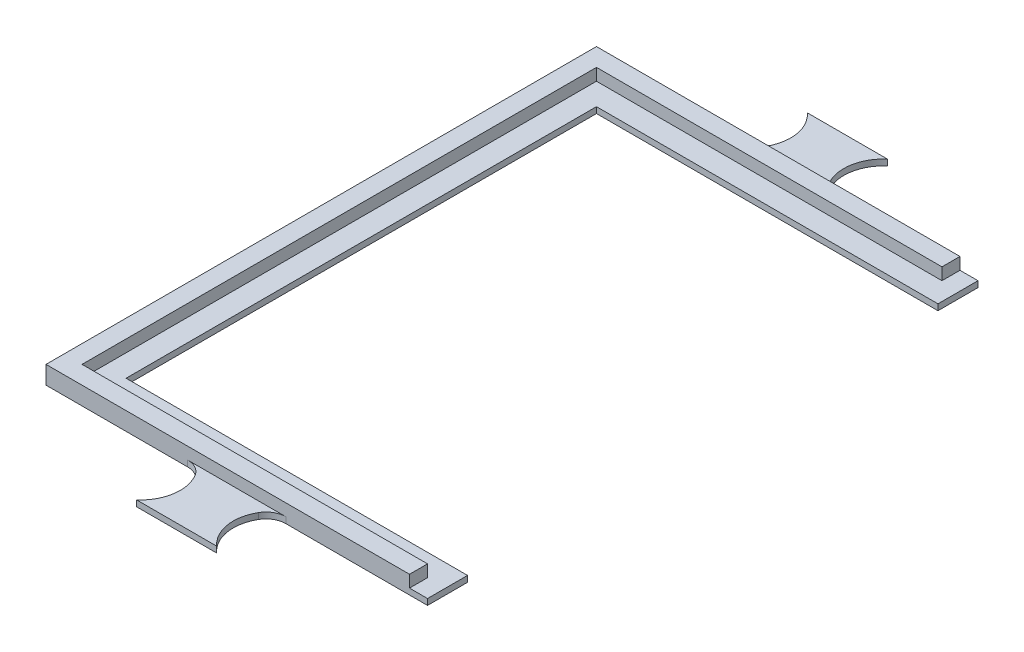
ISO-10303-21;
HEADER;
FILE_DESCRIPTION(('STEP AP214'),'2;1');
FILE_NAME('part.step','',(''),(''),'','','');
FILE_SCHEMA(('AUTOMOTIVE_DESIGN { 1 0 10303 214 1 1 1 1 }'));
ENDSEC;
DATA;
#1=APPLICATION_CONTEXT('core data for automotive mechanical design processes');
#2=APPLICATION_PROTOCOL_DEFINITION('international standard','automotive_design',2000,#1);
#3=PRODUCT_CONTEXT('',#1,'mechanical');
#4=PRODUCT('Part','Part','',(#3));
#5=PRODUCT_RELATED_PRODUCT_CATEGORY('part','',(#4));
#6=PRODUCT_DEFINITION_FORMATION('','',#4);
#7=PRODUCT_DEFINITION_CONTEXT('part definition',#1,'design');
#8=PRODUCT_DEFINITION('design','',#6,#7);
#9=PRODUCT_DEFINITION_SHAPE('','',#8);
#10=(LENGTH_UNIT() NAMED_UNIT(*) SI_UNIT(.MILLI.,.METRE.));
#11=(NAMED_UNIT(*) PLANE_ANGLE_UNIT() SI_UNIT($,.RADIAN.));
#12=(NAMED_UNIT(*) SI_UNIT($,.STERADIAN.) SOLID_ANGLE_UNIT());
#13=UNCERTAINTY_MEASURE_WITH_UNIT(LENGTH_MEASURE(1.E-05),#10,'distance_accuracy_value','');
#14=(GEOMETRIC_REPRESENTATION_CONTEXT(3) GLOBAL_UNCERTAINTY_ASSIGNED_CONTEXT((#13)) GLOBAL_UNIT_ASSIGNED_CONTEXT((#10,
#11,#12)) REPRESENTATION_CONTEXT('',''));
#15=CARTESIAN_POINT('',(0.,0.,0.));
#16=DIRECTION('',(0.,0.,1.));
#17=DIRECTION('',(1.,0.,0.));
#18=AXIS2_PLACEMENT_3D('',#15,#16,#17);
#19=CARTESIAN_POINT('',(0.,1.5,0.));
#20=DIRECTION('',(0.,1.,0.));
#21=DIRECTION('',(0.,0.,1.));
#22=AXIS2_PLACEMENT_3D('',#19,#20,#21);
#23=PLANE('',#22);
#24=DIRECTION('',(1.,0.,0.));
#25=VECTOR('',#24,1.);
#26=CARTESIAN_POINT('',(0.,1.5,68.75));
#27=LINE('',#26,#25);
#28=CARTESIAN_POINT('',(-12.2842512587393,1.5,68.75));
#29=VERTEX_POINT('',#28);
#30=CARTESIAN_POINT('',(12.2842512587393,1.5,68.75));
#31=VERTEX_POINT('',#30);
#32=EDGE_CURVE('E11',#29,#31,#27,.T.);
#33=ORIENTED_EDGE('',*,*,#32,.F.);
#34=CARTESIAN_POINT('',(-12.2842512587393,1.5,73.75));
#35=DIRECTION('',(0.,1.,0.));
#36=DIRECTION('',(0.,0.,1.));
#37=AXIS2_PLACEMENT_3D('',#34,#35,#36);
#38=CIRCLE('',#37,5.);
#39=CARTESIAN_POINT('',(-7.95412423981708,1.5,71.25));
#40=VERTEX_POINT('',#39);
#41=EDGE_CURVE('E267',#40,#29,#38,.T.);
#42=ORIENTED_EDGE('',*,*,#41,.F.);
#43=CARTESIAN_POINT('',(-16.6143782776615,1.5,76.25));
#44=DIRECTION('',(0.,1.,0.));
#45=DIRECTION('',(0.,0.,1.));
#46=AXIS2_PLACEMENT_3D('',#43,#44,#45);
#47=CIRCLE('',#46,10.);
#48=CARTESIAN_POINT('',(-9.99999999999999,1.5,83.75));
#49=VERTEX_POINT('',#48);
#50=EDGE_CURVE('E270',#40,#49,#47,.F.);
#51=ORIENTED_EDGE('',*,*,#50,.T.);
#52=DIRECTION('',(1.,0.,0.));
#53=VECTOR('',#52,1.);
#54=CARTESIAN_POINT('',(0.,1.5,83.75));
#55=LINE('',#54,#53);
#56=CARTESIAN_POINT('',(10.,1.5,83.75));
#57=VERTEX_POINT('',#56);
#58=EDGE_CURVE('E273',#49,#57,#55,.T.);
#59=ORIENTED_EDGE('',*,*,#58,.T.);
#60=CARTESIAN_POINT('',(16.6143782776615,1.5,76.25));
#61=DIRECTION('',(0.,1.,0.));
#62=DIRECTION('',(0.,0.,1.));
#63=AXIS2_PLACEMENT_3D('',#60,#61,#62);
#64=CIRCLE('',#63,10.);
#65=CARTESIAN_POINT('',(7.95412423981711,1.5,71.25));
#66=VERTEX_POINT('',#65);
#67=EDGE_CURVE('E275',#66,#57,#64,.T.);
#68=ORIENTED_EDGE('',*,*,#67,.F.);
#69=CARTESIAN_POINT('',(12.2842512587393,1.5,73.75));
#70=DIRECTION('',(0.,1.,0.));
#71=DIRECTION('',(0.,0.,1.));
#72=AXIS2_PLACEMENT_3D('',#69,#70,#71);
#73=CIRCLE('',#72,5.);
#74=EDGE_CURVE('E278',#66,#31,#73,.F.);
#75=ORIENTED_EDGE('',*,*,#74,.T.);
#76=EDGE_LOOP('',(#33,#42,#51,#59,#68,#75));
#77=FACE_BOUND('',#76,.T.);
#78=ADVANCED_FACE('F33',(#77),#23,.T.);
#79=DIRECTION('',(-1.,0.,0.));
#80=VECTOR('',#79,1.);
#81=CARTESIAN_POINT('',(0.,1.5,64.25));
#82=LINE('',#81,#80);
#83=CARTESIAN_POINT('',(43.15,1.5,64.25));
#84=VERTEX_POINT('',#83);
#85=CARTESIAN_POINT('',(-43.15,1.5,64.25));
#86=VERTEX_POINT('',#85);
#87=EDGE_CURVE('E250',#84,#86,#82,.T.);
#88=ORIENTED_EDGE('',*,*,#87,.F.);
#89=DIRECTION('',(0.,0.,1.));
#90=VECTOR('',#89,1.);
#91=CARTESIAN_POINT('',(43.15,1.5,0.));
#92=LINE('',#91,#90);
#93=CARTESIAN_POINT('',(43.15,1.5,68.75));
#94=VERTEX_POINT('',#93);
#95=EDGE_CURVE('E214',#84,#94,#92,.T.);
#96=ORIENTED_EDGE('',*,*,#95,.T.);
#97=DIRECTION('',(1.,0.,0.));
#98=VECTOR('',#97,1.);
#99=CARTESIAN_POINT('',(0.,1.5,68.75));
#100=LINE('',#99,#98);
#101=CARTESIAN_POINT('',(47.65,1.5,68.75));
#102=VERTEX_POINT('',#101);
#103=EDGE_CURVE('E280',#94,#102,#100,.T.);
#104=ORIENTED_EDGE('',*,*,#103,.T.);
#105=DIRECTION('',(0.,0.,-1.));
#106=VECTOR('',#105,1.);
#107=CARTESIAN_POINT('',(47.65,1.5,0.));
#108=LINE('',#107,#106);
#109=CARTESIAN_POINT('',(47.65,1.5,58.75));
#110=VERTEX_POINT('',#109);
#111=EDGE_CURVE('E282',#102,#110,#108,.T.);
#112=ORIENTED_EDGE('',*,*,#111,.T.);
#113=DIRECTION('',(1.,0.,0.));
#114=VECTOR('',#113,1.);
#115=CARTESIAN_POINT('',(0.,1.5,58.75));
#116=LINE('',#115,#114);
#117=CARTESIAN_POINT('',(-37.65,1.5,58.75));
#118=VERTEX_POINT('',#117);
#119=EDGE_CURVE('E284',#118,#110,#116,.T.);
#120=ORIENTED_EDGE('',*,*,#119,.F.);
#121=DIRECTION('',(0.,0.,-1.));
#122=VECTOR('',#121,1.);
#123=CARTESIAN_POINT('',(-37.65,1.5,0.));
#124=LINE('',#123,#122);
#125=CARTESIAN_POINT('',(-37.65,1.5,-58.75));
#126=VERTEX_POINT('',#125);
#127=EDGE_CURVE('E287',#118,#126,#124,.T.);
#128=ORIENTED_EDGE('',*,*,#127,.T.);
#129=DIRECTION('',(1.,0.,0.));
#130=VECTOR('',#129,1.);
#131=CARTESIAN_POINT('',(0.,1.5,-58.75));
#132=LINE('',#131,#130);
#133=CARTESIAN_POINT('',(47.65,1.5,-58.75));
#134=VERTEX_POINT('',#133);
#135=EDGE_CURVE('E289',#126,#134,#132,.T.);
#136=ORIENTED_EDGE('',*,*,#135,.T.);
#137=DIRECTION('',(0.,0.,1.));
#138=VECTOR('',#137,1.);
#139=CARTESIAN_POINT('',(47.65,1.5,0.));
#140=LINE('',#139,#138);
#141=CARTESIAN_POINT('',(47.65,1.5,-68.75));
#142=VERTEX_POINT('',#141);
#143=EDGE_CURVE('E291',#142,#134,#140,.T.);
#144=ORIENTED_EDGE('',*,*,#143,.F.);
#145=DIRECTION('',(1.,0.,0.));
#146=VECTOR('',#145,1.);
#147=CARTESIAN_POINT('',(0.,1.5,-68.75));
#148=LINE('',#147,#146);
#149=CARTESIAN_POINT('',(43.15,1.5,-68.75));
#150=VERTEX_POINT('',#149);
#151=EDGE_CURVE('E294',#150,#142,#148,.T.);
#152=ORIENTED_EDGE('',*,*,#151,.F.);
#153=DIRECTION('',(0.,0.,-1.));
#154=VECTOR('',#153,1.);
#155=CARTESIAN_POINT('',(43.15,1.5,0.));
#156=LINE('',#155,#154);
#157=CARTESIAN_POINT('',(43.15,1.5,-64.25));
#158=VERTEX_POINT('',#157);
#159=EDGE_CURVE('E50',#158,#150,#156,.T.);
#160=ORIENTED_EDGE('',*,*,#159,.F.);
#161=DIRECTION('',(-1.,0.,0.));
#162=VECTOR('',#161,1.);
#163=CARTESIAN_POINT('',(0.,1.5,-64.25));
#164=LINE('',#163,#162);
#165=CARTESIAN_POINT('',(-43.15,1.5,-64.25));
#166=VERTEX_POINT('',#165);
#167=EDGE_CURVE('E55',#158,#166,#164,.T.);
#168=ORIENTED_EDGE('',*,*,#167,.T.);
#169=DIRECTION('',(0.,0.,-1.));
#170=VECTOR('',#169,1.);
#171=CARTESIAN_POINT('',(-43.15,1.5,0.));
#172=LINE('',#171,#170);
#173=EDGE_CURVE('E252',#86,#166,#172,.T.);
#174=ORIENTED_EDGE('',*,*,#173,.F.);
#175=EDGE_LOOP('',(#88,#96,#104,#112,#120,#128,#136,#144,#152,#160,#168,#174));
#176=FACE_BOUND('',#175,.T.);
#177=ADVANCED_FACE('F496',(#176),#23,.T.);
#178=CARTESIAN_POINT('',(-12.2842512587393,1.5,73.75));
#179=DIRECTION('',(0.,-1.,0.));
#180=DIRECTION('',(0.,0.,-1.));
#181=AXIS2_PLACEMENT_3D('',#178,#179,#180);
#182=CYLINDRICAL_SURFACE('',#181,5.);
#183=CARTESIAN_POINT('',(-12.2842512587393,0.,73.75));
#184=DIRECTION('',(0.,1.,0.));
#185=DIRECTION('',(0.,0.,1.));
#186=AXIS2_PLACEMENT_3D('',#183,#184,#185);
#187=CIRCLE('',#186,5.);
#188=CARTESIAN_POINT('',(-7.95412423981708,0.,71.25));
#189=VERTEX_POINT('',#188);
#190=CARTESIAN_POINT('',(-12.2842512587393,0.,68.75));
#191=VERTEX_POINT('',#190);
#192=EDGE_CURVE('E217',#189,#191,#187,.T.);
#193=ORIENTED_EDGE('',*,*,#192,.F.);
#194=DIRECTION('',(0.,-1.,0.));
#195=VECTOR('',#194,1.);
#196=CARTESIAN_POINT('',(-7.95412423981708,1.5,71.25));
#197=LINE('',#196,#195);
#198=EDGE_CURVE('E37',#40,#189,#197,.T.);
#199=ORIENTED_EDGE('',*,*,#198,.F.);
#200=ORIENTED_EDGE('',*,*,#41,.T.);
#201=DIRECTION('',(0.,-1.,0.));
#202=VECTOR('',#201,1.);
#203=CARTESIAN_POINT('',(-12.2842512587393,1.5,68.75));
#204=LINE('',#203,#202);
#205=EDGE_CURVE('E309',#29,#191,#204,.T.);
#206=ORIENTED_EDGE('',*,*,#205,.T.);
#207=EDGE_LOOP('',(#193,#199,#200,#206));
#208=FACE_BOUND('',#207,.T.);
#209=ADVANCED_FACE('F35',(#208),#182,.F.);
#210=CARTESIAN_POINT('',(-16.6143782776615,1.5,76.25));
#211=DIRECTION('',(0.,-1.,0.));
#212=DIRECTION('',(0.,0.,-1.));
#213=AXIS2_PLACEMENT_3D('',#210,#211,#212);
#214=CYLINDRICAL_SURFACE('',#213,10.);
#215=CARTESIAN_POINT('',(-16.6143782776615,0.,76.25));
#216=DIRECTION('',(0.,1.,0.));
#217=DIRECTION('',(0.,0.,1.));
#218=AXIS2_PLACEMENT_3D('',#215,#216,#217);
#219=CIRCLE('',#218,10.);
#220=CARTESIAN_POINT('',(-9.99999999999999,0.,83.75));
#221=VERTEX_POINT('',#220);
#222=EDGE_CURVE('E312',#189,#221,#219,.F.);
#223=ORIENTED_EDGE('',*,*,#222,.T.);
#224=DIRECTION('',(0.,-1.,0.));
#225=VECTOR('',#224,1.);
#226=CARTESIAN_POINT('',(-9.99999999999999,1.5,83.75));
#227=LINE('',#226,#225);
#228=EDGE_CURVE('E401',#49,#221,#227,.T.);
#229=ORIENTED_EDGE('',*,*,#228,.F.);
#230=ORIENTED_EDGE('',*,*,#50,.F.);
#231=ORIENTED_EDGE('',*,*,#198,.T.);
#232=EDGE_LOOP('',(#223,#229,#230,#231));
#233=FACE_BOUND('',#232,.T.);
#234=ADVANCED_FACE('F410',(#233),#214,.F.);
#235=CARTESIAN_POINT('',(0.,1.5,83.75));
#236=DIRECTION('',(0.,0.,-1.));
#237=DIRECTION('',(-1.,0.,0.));
#238=AXIS2_PLACEMENT_3D('',#235,#236,#237);
#239=PLANE('',#238);
#240=DIRECTION('',(1.,0.,0.));
#241=VECTOR('',#240,1.);
#242=CARTESIAN_POINT('',(0.,0.,83.75));
#243=LINE('',#242,#241);
#244=CARTESIAN_POINT('',(10.,0.,83.75));
#245=VERTEX_POINT('',#244);
#246=EDGE_CURVE('E314',#221,#245,#243,.T.);
#247=ORIENTED_EDGE('',*,*,#246,.T.);
#248=DIRECTION('',(0.,-1.,0.));
#249=VECTOR('',#248,1.);
#250=CARTESIAN_POINT('',(10.,1.5,83.75));
#251=LINE('',#250,#249);
#252=EDGE_CURVE('E400',#57,#245,#251,.T.);
#253=ORIENTED_EDGE('',*,*,#252,.F.);
#254=ORIENTED_EDGE('',*,*,#58,.F.);
#255=ORIENTED_EDGE('',*,*,#228,.T.);
#256=EDGE_LOOP('',(#247,#253,#254,#255));
#257=FACE_BOUND('',#256,.T.);
#258=ADVANCED_FACE('F487',(#257),#239,.F.);
#259=CARTESIAN_POINT('',(16.6143782776615,1.5,76.25));
#260=DIRECTION('',(0.,-1.,0.));
#261=DIRECTION('',(0.,0.,-1.));
#262=AXIS2_PLACEMENT_3D('',#259,#260,#261);
#263=CYLINDRICAL_SURFACE('',#262,10.);
#264=CARTESIAN_POINT('',(16.6143782776615,0.,76.25));
#265=DIRECTION('',(0.,1.,0.));
#266=DIRECTION('',(0.,0.,1.));
#267=AXIS2_PLACEMENT_3D('',#264,#265,#266);
#268=CIRCLE('',#267,10.);
#269=CARTESIAN_POINT('',(7.95412423981711,0.,71.25));
#270=VERTEX_POINT('',#269);
#271=EDGE_CURVE('E317',#270,#245,#268,.T.);
#272=ORIENTED_EDGE('',*,*,#271,.F.);
#273=DIRECTION('',(0.,-1.,0.));
#274=VECTOR('',#273,1.);
#275=CARTESIAN_POINT('',(7.95412423981711,1.5,71.25));
#276=LINE('',#275,#274);
#277=EDGE_CURVE('E398',#66,#270,#276,.T.);
#278=ORIENTED_EDGE('',*,*,#277,.F.);
#279=ORIENTED_EDGE('',*,*,#67,.T.);
#280=ORIENTED_EDGE('',*,*,#252,.T.);
#281=EDGE_LOOP('',(#272,#278,#279,#280));
#282=FACE_BOUND('',#281,.T.);
#283=ADVANCED_FACE('F485',(#282),#263,.F.);
#284=CARTESIAN_POINT('',(12.2842512587393,1.5,73.75));
#285=DIRECTION('',(0.,-1.,0.));
#286=DIRECTION('',(0.,0.,-1.));
#287=AXIS2_PLACEMENT_3D('',#284,#285,#286);
#288=CYLINDRICAL_SURFACE('',#287,5.);
#289=CARTESIAN_POINT('',(12.2842512587393,0.,73.75));
#290=DIRECTION('',(0.,1.,0.));
#291=DIRECTION('',(0.,0.,1.));
#292=AXIS2_PLACEMENT_3D('',#289,#290,#291);
#293=CIRCLE('',#292,5.);
#294=CARTESIAN_POINT('',(12.2842512587393,0.,68.75));
#295=VERTEX_POINT('',#294);
#296=EDGE_CURVE('E320',#270,#295,#293,.F.);
#297=ORIENTED_EDGE('',*,*,#296,.T.);
#298=DIRECTION('',(0.,-1.,0.));
#299=VECTOR('',#298,1.);
#300=CARTESIAN_POINT('',(12.2842512587393,1.5,68.75));
#301=LINE('',#300,#299);
#302=EDGE_CURVE('E395',#31,#295,#301,.T.);
#303=ORIENTED_EDGE('',*,*,#302,.F.);
#304=ORIENTED_EDGE('',*,*,#74,.F.);
#305=ORIENTED_EDGE('',*,*,#277,.T.);
#306=EDGE_LOOP('',(#297,#303,#304,#305));
#307=FACE_BOUND('',#306,.T.);
#308=ADVANCED_FACE('F482',(#307),#288,.F.);
#309=CARTESIAN_POINT('',(47.65,1.5,0.));
#310=DIRECTION('',(-1.,0.,0.));
#311=DIRECTION('',(0.,0.,1.));
#312=AXIS2_PLACEMENT_3D('',#309,#310,#311);
#313=PLANE('',#312);
#314=DIRECTION('',(0.,0.,-1.));
#315=VECTOR('',#314,1.);
#316=CARTESIAN_POINT('',(47.65,0.,0.));
#317=LINE('',#316,#315);
#318=CARTESIAN_POINT('',(47.65,0.,68.75));
#319=VERTEX_POINT('',#318);
#320=CARTESIAN_POINT('',(47.65,0.,58.75));
#321=VERTEX_POINT('',#320);
#322=EDGE_CURVE('E324',#319,#321,#317,.T.);
#323=ORIENTED_EDGE('',*,*,#322,.T.);
#324=DIRECTION('',(0.,-1.,0.));
#325=VECTOR('',#324,1.);
#326=CARTESIAN_POINT('',(47.65,1.5,58.75));
#327=LINE('',#326,#325);
#328=EDGE_CURVE('E390',#110,#321,#327,.T.);
#329=ORIENTED_EDGE('',*,*,#328,.F.);
#330=ORIENTED_EDGE('',*,*,#111,.F.);
#331=DIRECTION('',(0.,-1.,0.));
#332=VECTOR('',#331,1.);
#333=CARTESIAN_POINT('',(47.65,1.5,68.75));
#334=LINE('',#333,#332);
#335=EDGE_CURVE('E392',#102,#319,#334,.T.);
#336=ORIENTED_EDGE('',*,*,#335,.T.);
#337=EDGE_LOOP('',(#323,#329,#330,#336));
#338=FACE_BOUND('',#337,.T.);
#339=ADVANCED_FACE('F473',(#338),#313,.F.);
#340=CARTESIAN_POINT('',(0.,1.5,58.75));
#341=DIRECTION('',(0.,0.,-1.));
#342=DIRECTION('',(-1.,0.,0.));
#343=AXIS2_PLACEMENT_3D('',#340,#341,#342);
#344=PLANE('',#343);
#345=DIRECTION('',(1.,0.,0.));
#346=VECTOR('',#345,1.);
#347=CARTESIAN_POINT('',(0.,0.,58.75));
#348=LINE('',#347,#346);
#349=CARTESIAN_POINT('',(-37.65,0.,58.75));
#350=VERTEX_POINT('',#349);
#351=EDGE_CURVE('E327',#350,#321,#348,.T.);
#352=ORIENTED_EDGE('',*,*,#351,.F.);
#353=DIRECTION('',(0.,-1.,0.));
#354=VECTOR('',#353,1.);
#355=CARTESIAN_POINT('',(-37.65,1.5,58.75));
#356=LINE('',#355,#354);
#357=EDGE_CURVE('E388',#118,#350,#356,.T.);
#358=ORIENTED_EDGE('',*,*,#357,.F.);
#359=ORIENTED_EDGE('',*,*,#119,.T.);
#360=ORIENTED_EDGE('',*,*,#328,.T.);
#361=EDGE_LOOP('',(#352,#358,#359,#360));
#362=FACE_BOUND('',#361,.T.);
#363=ADVANCED_FACE('F469',(#362),#344,.T.);
#364=CARTESIAN_POINT('',(-37.65,1.5,0.));
#365=DIRECTION('',(-1.,0.,0.));
#366=DIRECTION('',(0.,0.,1.));
#367=AXIS2_PLACEMENT_3D('',#364,#365,#366);
#368=PLANE('',#367);
#369=DIRECTION('',(0.,0.,-1.));
#370=VECTOR('',#369,1.);
#371=CARTESIAN_POINT('',(-37.65,0.,0.));
#372=LINE('',#371,#370);
#373=CARTESIAN_POINT('',(-37.65,0.,-58.75));
#374=VERTEX_POINT('',#373);
#375=EDGE_CURVE('E330',#350,#374,#372,.T.);
#376=ORIENTED_EDGE('',*,*,#375,.T.);
#377=DIRECTION('',(0.,-1.,0.));
#378=VECTOR('',#377,1.);
#379=CARTESIAN_POINT('',(-37.65,1.5,-58.75));
#380=LINE('',#379,#378);
#381=EDGE_CURVE('E385',#126,#374,#380,.T.);
#382=ORIENTED_EDGE('',*,*,#381,.F.);
#383=ORIENTED_EDGE('',*,*,#127,.F.);
#384=ORIENTED_EDGE('',*,*,#357,.T.);
#385=EDGE_LOOP('',(#376,#382,#383,#384));
#386=FACE_BOUND('',#385,.T.);
#387=ADVANCED_FACE('F464',(#386),#368,.F.);
#388=CARTESIAN_POINT('',(0.,1.5,-58.75));
#389=DIRECTION('',(0.,0.,-1.));
#390=DIRECTION('',(-1.,0.,0.));
#391=AXIS2_PLACEMENT_3D('',#388,#389,#390);
#392=PLANE('',#391);
#393=DIRECTION('',(1.,0.,0.));
#394=VECTOR('',#393,1.);
#395=CARTESIAN_POINT('',(0.,0.,-58.75));
#396=LINE('',#395,#394);
#397=CARTESIAN_POINT('',(47.65,0.,-58.75));
#398=VERTEX_POINT('',#397);
#399=EDGE_CURVE('E332',#374,#398,#396,.T.);
#400=ORIENTED_EDGE('',*,*,#399,.T.);
#401=DIRECTION('',(0.,-1.,0.));
#402=VECTOR('',#401,1.);
#403=CARTESIAN_POINT('',(47.65,1.5,-58.75));
#404=LINE('',#403,#402);
#405=EDGE_CURVE('E383',#134,#398,#404,.T.);
#406=ORIENTED_EDGE('',*,*,#405,.F.);
#407=ORIENTED_EDGE('',*,*,#135,.F.);
#408=ORIENTED_EDGE('',*,*,#381,.T.);
#409=EDGE_LOOP('',(#400,#406,#407,#408));
#410=FACE_BOUND('',#409,.T.);
#411=ADVANCED_FACE('F460',(#410),#392,.F.);
#412=CARTESIAN_POINT('',(47.65,1.5,0.));
#413=DIRECTION('',(1.,0.,0.));
#414=DIRECTION('',(0.,0.,-1.));
#415=AXIS2_PLACEMENT_3D('',#412,#413,#414);
#416=PLANE('',#415);
#417=DIRECTION('',(0.,0.,1.));
#418=VECTOR('',#417,1.);
#419=CARTESIAN_POINT('',(47.65,0.,0.));
#420=LINE('',#419,#418);
#421=CARTESIAN_POINT('',(47.65,0.,-68.75));
#422=VERTEX_POINT('',#421);
#423=EDGE_CURVE('E335',#422,#398,#420,.T.);
#424=ORIENTED_EDGE('',*,*,#423,.F.);
#425=DIRECTION('',(0.,-1.,0.));
#426=VECTOR('',#425,1.);
#427=CARTESIAN_POINT('',(47.65,1.5,-68.75));
#428=LINE('',#427,#426);
#429=EDGE_CURVE('E381',#142,#422,#428,.T.);
#430=ORIENTED_EDGE('',*,*,#429,.F.);
#431=ORIENTED_EDGE('',*,*,#143,.T.);
#432=ORIENTED_EDGE('',*,*,#405,.T.);
#433=EDGE_LOOP('',(#424,#430,#431,#432));
#434=FACE_BOUND('',#433,.T.);
#435=ADVANCED_FACE('F455',(#434),#416,.T.);
#436=CARTESIAN_POINT('',(12.2842512587393,1.5,-73.75));
#437=DIRECTION('',(0.,-1.,0.));
#438=DIRECTION('',(0.,0.,-1.));
#439=AXIS2_PLACEMENT_3D('',#436,#437,#438);
#440=CYLINDRICAL_SURFACE('',#439,5.);
#441=CARTESIAN_POINT('',(12.2842512587393,0.,-73.75));
#442=DIRECTION('',(0.,1.,0.));
#443=DIRECTION('',(0.,0.,1.));
#444=AXIS2_PLACEMENT_3D('',#441,#442,#443);
#445=CIRCLE('',#444,5.);
#446=CARTESIAN_POINT('',(7.95412423981709,0.,-71.25));
#447=VERTEX_POINT('',#446);
#448=CARTESIAN_POINT('',(12.2842512587393,0.,-68.75));
#449=VERTEX_POINT('',#448);
#450=EDGE_CURVE('E341',#447,#449,#445,.T.);
#451=ORIENTED_EDGE('',*,*,#450,.F.);
#452=DIRECTION('',(0.,-1.,0.));
#453=VECTOR('',#452,1.);
#454=CARTESIAN_POINT('',(7.95412423981709,1.5,-71.25));
#455=LINE('',#454,#453);
#456=CARTESIAN_POINT('',(7.95412423981709,1.5,-71.25));
#457=VERTEX_POINT('',#456);
#458=EDGE_CURVE('E377',#457,#447,#455,.T.);
#459=ORIENTED_EDGE('',*,*,#458,.F.);
#460=CARTESIAN_POINT('',(12.2842512587393,1.5,-73.75));
#461=DIRECTION('',(0.,1.,0.));
#462=DIRECTION('',(0.,0.,1.));
#463=AXIS2_PLACEMENT_3D('',#460,#461,#462);
#464=CIRCLE('',#463,5.);
#465=CARTESIAN_POINT('',(12.2842512587393,1.5,-68.75));
#466=VERTEX_POINT('',#465);
#467=EDGE_CURVE('E296',#457,#466,#464,.T.);
#468=ORIENTED_EDGE('',*,*,#467,.T.);
#469=DIRECTION('',(0.,-1.,0.));
#470=VECTOR('',#469,1.);
#471=CARTESIAN_POINT('',(12.2842512587393,1.5,-68.75));
#472=LINE('',#471,#470);
#473=EDGE_CURVE('E379',#466,#449,#472,.T.);
#474=ORIENTED_EDGE('',*,*,#473,.T.);
#475=EDGE_LOOP('',(#451,#459,#468,#474));
#476=FACE_BOUND('',#475,.T.);
#477=ADVANCED_FACE('F445',(#476),#440,.F.);
#478=CARTESIAN_POINT('',(16.6143782776615,1.5,-76.25));
#479=DIRECTION('',(0.,-1.,0.));
#480=DIRECTION('',(0.,0.,-1.));
#481=AXIS2_PLACEMENT_3D('',#478,#479,#480);
#482=CYLINDRICAL_SURFACE('',#481,10.);
#483=CARTESIAN_POINT('',(16.6143782776615,0.,-76.25));
#484=DIRECTION('',(0.,1.,0.));
#485=DIRECTION('',(0.,0.,1.));
#486=AXIS2_PLACEMENT_3D('',#483,#484,#485);
#487=CIRCLE('',#486,10.);
#488=CARTESIAN_POINT('',(10.,0.,-83.75));
#489=VERTEX_POINT('',#488);
#490=EDGE_CURVE('E344',#447,#489,#487,.F.);
#491=ORIENTED_EDGE('',*,*,#490,.T.);
#492=DIRECTION('',(0.,-1.,0.));
#493=VECTOR('',#492,1.);
#494=CARTESIAN_POINT('',(10.,1.5,-83.75));
#495=LINE('',#494,#493);
#496=CARTESIAN_POINT('',(10.,1.5,-83.75));
#497=VERTEX_POINT('',#496);
#498=EDGE_CURVE('E375',#497,#489,#495,.T.);
#499=ORIENTED_EDGE('',*,*,#498,.F.);
#500=CARTESIAN_POINT('',(16.6143782776615,1.5,-76.25));
#501=DIRECTION('',(0.,1.,0.));
#502=DIRECTION('',(0.,0.,1.));
#503=AXIS2_PLACEMENT_3D('',#500,#501,#502);
#504=CIRCLE('',#503,10.);
#505=EDGE_CURVE('E299',#457,#497,#504,.F.);
#506=ORIENTED_EDGE('',*,*,#505,.F.);
#507=ORIENTED_EDGE('',*,*,#458,.T.);
#508=EDGE_LOOP('',(#491,#499,#506,#507));
#509=FACE_BOUND('',#508,.T.);
#510=ADVANCED_FACE('F525',(#509),#482,.F.);
#511=CARTESIAN_POINT('',(0.,1.5,-83.75));
#512=DIRECTION('',(0.,0.,-1.));
#513=DIRECTION('',(-1.,0.,0.));
#514=AXIS2_PLACEMENT_3D('',#511,#512,#513);
#515=PLANE('',#514);
#516=DIRECTION('',(1.,0.,0.));
#517=VECTOR('',#516,1.);
#518=CARTESIAN_POINT('',(0.,0.,-83.75));
#519=LINE('',#518,#517);
#520=CARTESIAN_POINT('',(-10.,0.,-83.75));
#521=VERTEX_POINT('',#520);
#522=EDGE_CURVE('E347',#521,#489,#519,.T.);
#523=ORIENTED_EDGE('',*,*,#522,.F.);
#524=DIRECTION('',(0.,-1.,0.));
#525=VECTOR('',#524,1.);
#526=CARTESIAN_POINT('',(-10.,1.5,-83.75));
#527=LINE('',#526,#525);
#528=CARTESIAN_POINT('',(-10.,1.5,-83.75));
#529=VERTEX_POINT('',#528);
#530=EDGE_CURVE('E373',#529,#521,#527,.T.);
#531=ORIENTED_EDGE('',*,*,#530,.F.);
#532=DIRECTION('',(1.,0.,0.));
#533=VECTOR('',#532,1.);
#534=CARTESIAN_POINT('',(0.,1.5,-83.75));
#535=LINE('',#534,#533);
#536=EDGE_CURVE('E301',#529,#497,#535,.T.);
#537=ORIENTED_EDGE('',*,*,#536,.T.);
#538=ORIENTED_EDGE('',*,*,#498,.T.);
#539=EDGE_LOOP('',(#523,#531,#537,#538));
#540=FACE_BOUND('',#539,.T.);
#541=ADVANCED_FACE('F439',(#540),#515,.T.);
#542=CARTESIAN_POINT('',(-16.6143782776615,1.5,-76.25));
#543=DIRECTION('',(0.,-1.,0.));
#544=DIRECTION('',(0.,0.,-1.));
#545=AXIS2_PLACEMENT_3D('',#542,#543,#544);
#546=CYLINDRICAL_SURFACE('',#545,10.);
#547=CARTESIAN_POINT('',(-16.6143782776615,0.,-76.25));
#548=DIRECTION('',(0.,1.,0.));
#549=DIRECTION('',(0.,0.,1.));
#550=AXIS2_PLACEMENT_3D('',#547,#548,#549);
#551=CIRCLE('',#550,10.);
#552=CARTESIAN_POINT('',(-7.95412423981709,0.,-71.25));
#553=VERTEX_POINT('',#552);
#554=EDGE_CURVE('E350',#553,#521,#551,.T.);
#555=ORIENTED_EDGE('',*,*,#554,.F.);
#556=DIRECTION('',(0.,-1.,0.));
#557=VECTOR('',#556,1.);
#558=CARTESIAN_POINT('',(-7.95412423981709,1.5,-71.25));
#559=LINE('',#558,#557);
#560=CARTESIAN_POINT('',(-7.95412423981709,1.5,-71.25));
#561=VERTEX_POINT('',#560);
#562=EDGE_CURVE('E371',#561,#553,#559,.T.);
#563=ORIENTED_EDGE('',*,*,#562,.F.);
#564=CARTESIAN_POINT('',(-16.6143782776615,1.5,-76.25));
#565=DIRECTION('',(0.,1.,0.));
#566=DIRECTION('',(0.,0.,1.));
#567=AXIS2_PLACEMENT_3D('',#564,#565,#566);
#568=CIRCLE('',#567,10.);
#569=EDGE_CURVE('E304',#561,#529,#568,.T.);
#570=ORIENTED_EDGE('',*,*,#569,.T.);
#571=ORIENTED_EDGE('',*,*,#530,.T.);
#572=EDGE_LOOP('',(#555,#563,#570,#571));
#573=FACE_BOUND('',#572,.T.);
#574=ADVANCED_FACE('F433',(#573),#546,.F.);
#575=CARTESIAN_POINT('',(-12.2842512587393,1.5,-73.75));
#576=DIRECTION('',(0.,-1.,0.));
#577=DIRECTION('',(0.,0.,-1.));
#578=AXIS2_PLACEMENT_3D('',#575,#576,#577);
#579=CYLINDRICAL_SURFACE('',#578,5.00000000000001);
#580=CARTESIAN_POINT('',(-12.2842512587393,0.,-73.75));
#581=DIRECTION('',(0.,1.,0.));
#582=DIRECTION('',(0.,0.,1.));
#583=AXIS2_PLACEMENT_3D('',#580,#581,#582);
#584=CIRCLE('',#583,5.00000000000001);
#585=CARTESIAN_POINT('',(-12.2842512587393,0.,-68.75));
#586=VERTEX_POINT('',#585);
#587=EDGE_CURVE('E353',#553,#586,#584,.F.);
#588=ORIENTED_EDGE('',*,*,#587,.T.);
#589=DIRECTION('',(0.,-1.,0.));
#590=VECTOR('',#589,1.);
#591=CARTESIAN_POINT('',(-12.2842512587393,1.5,-68.75));
#592=LINE('',#591,#590);
#593=CARTESIAN_POINT('',(-12.2842512587393,1.5,-68.75));
#594=VERTEX_POINT('',#593);
#595=EDGE_CURVE('E369',#594,#586,#592,.T.);
#596=ORIENTED_EDGE('',*,*,#595,.F.);
#597=CARTESIAN_POINT('',(-12.2842512587393,1.5,-73.75));
#598=DIRECTION('',(0.,1.,0.));
#599=DIRECTION('',(0.,0.,1.));
#600=AXIS2_PLACEMENT_3D('',#597,#598,#599);
#601=CIRCLE('',#600,5.00000000000001);
#602=EDGE_CURVE('E307',#561,#594,#601,.F.);
#603=ORIENTED_EDGE('',*,*,#602,.F.);
#604=ORIENTED_EDGE('',*,*,#562,.T.);
#605=EDGE_LOOP('',(#588,#596,#603,#604));
#606=FACE_BOUND('',#605,.T.);
#607=ADVANCED_FACE('F512',(#606),#579,.F.);
#608=CARTESIAN_POINT('',(0.,1.5,-68.75));
#609=DIRECTION('',(0.,0.,-1.));
#610=DIRECTION('',(-1.,0.,0.));
#611=AXIS2_PLACEMENT_3D('',#608,#609,#610);
#612=PLANE('',#611);
#613=DIRECTION('',(1.,0.,0.));
#614=VECTOR('',#613,1.);
#615=CARTESIAN_POINT('',(0.,0.,-68.75));
#616=LINE('',#615,#614);
#617=CARTESIAN_POINT('',(-47.65,0.,-68.75));
#618=VERTEX_POINT('',#617);
#619=EDGE_CURVE('E356',#618,#586,#616,.T.);
#620=ORIENTED_EDGE('',*,*,#619,.F.);
#621=DIRECTION('',(0.,-1.,0.));
#622=VECTOR('',#621,1.);
#623=CARTESIAN_POINT('',(-47.65,1.5,-68.75));
#624=LINE('',#623,#622);
#625=CARTESIAN_POINT('',(-47.65,4.5,-68.75));
#626=VERTEX_POINT('',#625);
#627=EDGE_CURVE('E367',#626,#618,#624,.T.);
#628=ORIENTED_EDGE('',*,*,#627,.F.);
#629=DIRECTION('',(-1.,0.,0.));
#630=VECTOR('',#629,1.);
#631=CARTESIAN_POINT('',(0.,4.5,-68.75));
#632=LINE('',#631,#630);
#633=CARTESIAN_POINT('',(43.15,4.5,-68.75));
#634=VERTEX_POINT('',#633);
#635=EDGE_CURVE('E242',#634,#626,#632,.T.);
#636=ORIENTED_EDGE('',*,*,#635,.F.);
#637=DIRECTION('',(0.,-1.,0.));
#638=VECTOR('',#637,1.);
#639=CARTESIAN_POINT('',(43.15,4.5,-68.75));
#640=LINE('',#639,#638);
#641=EDGE_CURVE('E259',#634,#150,#640,.T.);
#642=ORIENTED_EDGE('',*,*,#641,.T.);
#643=ORIENTED_EDGE('',*,*,#151,.T.);
#644=ORIENTED_EDGE('',*,*,#429,.T.);
#645=DIRECTION('',(1.,0.,0.));
#646=VECTOR('',#645,1.);
#647=CARTESIAN_POINT('',(0.,0.,-68.75));
#648=LINE('',#647,#646);
#649=EDGE_CURVE('E338',#449,#422,#648,.T.);
#650=ORIENTED_EDGE('',*,*,#649,.F.);
#651=ORIENTED_EDGE('',*,*,#473,.F.);
#652=DIRECTION('',(-1.,0.,0.));
#653=VECTOR('',#652,1.);
#654=CARTESIAN_POINT('',(0.,1.5,-68.75));
#655=LINE('',#654,#653);
#656=EDGE_CURVE('E42',#466,#594,#655,.T.);
#657=ORIENTED_EDGE('',*,*,#656,.T.);
#658=ORIENTED_EDGE('',*,*,#595,.T.);
#659=EDGE_LOOP('',(#620,#628,#636,#642,#643,#644,#650,#651,#657,#658));
#660=FACE_BOUND('',#659,.T.);
#661=ADVANCED_FACE('F427',(#660),#612,.T.);
#662=CARTESIAN_POINT('',(-47.65,1.5,0.));
#663=DIRECTION('',(-1.,0.,0.));
#664=DIRECTION('',(0.,0.,1.));
#665=AXIS2_PLACEMENT_3D('',#662,#663,#664);
#666=PLANE('',#665);
#667=DIRECTION('',(0.,0.,-1.));
#668=VECTOR('',#667,1.);
#669=CARTESIAN_POINT('',(-47.65,0.,0.));
#670=LINE('',#669,#668);
#671=CARTESIAN_POINT('',(-47.65,0.,68.75));
#672=VERTEX_POINT('',#671);
#673=EDGE_CURVE('E359',#672,#618,#670,.T.);
#674=ORIENTED_EDGE('',*,*,#673,.F.);
#675=DIRECTION('',(0.,-1.,0.));
#676=VECTOR('',#675,1.);
#677=CARTESIAN_POINT('',(-47.65,1.5,68.75));
#678=LINE('',#677,#676);
#679=CARTESIAN_POINT('',(-47.65,4.5,68.75));
#680=VERTEX_POINT('',#679);
#681=EDGE_CURVE('E365',#680,#672,#678,.T.);
#682=ORIENTED_EDGE('',*,*,#681,.F.);
#683=DIRECTION('',(0.,0.,1.));
#684=VECTOR('',#683,1.);
#685=CARTESIAN_POINT('',(-47.65,4.5,0.));
#686=LINE('',#685,#684);
#687=EDGE_CURVE('E245',#626,#680,#686,.T.);
#688=ORIENTED_EDGE('',*,*,#687,.F.);
#689=ORIENTED_EDGE('',*,*,#627,.T.);
#690=EDGE_LOOP('',(#674,#682,#688,#689));
#691=FACE_BOUND('',#690,.T.);
#692=ADVANCED_FACE('F422',(#691),#666,.T.);
#693=CARTESIAN_POINT('',(0.,1.5,68.75));
#694=DIRECTION('',(0.,0.,-1.));
#695=DIRECTION('',(-1.,0.,0.));
#696=AXIS2_PLACEMENT_3D('',#693,#694,#695);
#697=PLANE('',#696);
#698=DIRECTION('',(1.,0.,0.));
#699=VECTOR('',#698,1.);
#700=CARTESIAN_POINT('',(0.,0.,68.75));
#701=LINE('',#700,#699);
#702=EDGE_CURVE('E271',#672,#191,#701,.T.);
#703=ORIENTED_EDGE('',*,*,#702,.T.);
#704=ORIENTED_EDGE('',*,*,#205,.F.);
#705=ORIENTED_EDGE('',*,*,#32,.T.);
#706=ORIENTED_EDGE('',*,*,#302,.T.);
#707=DIRECTION('',(1.,0.,0.));
#708=VECTOR('',#707,1.);
#709=CARTESIAN_POINT('',(0.,0.,68.75));
#710=LINE('',#709,#708);
#711=EDGE_CURVE('E322',#295,#319,#710,.T.);
#712=ORIENTED_EDGE('',*,*,#711,.T.);
#713=ORIENTED_EDGE('',*,*,#335,.F.);
#714=ORIENTED_EDGE('',*,*,#103,.F.);
#715=DIRECTION('',(0.,-1.,0.));
#716=VECTOR('',#715,1.);
#717=CARTESIAN_POINT('',(43.15,4.5,68.75));
#718=LINE('',#717,#716);
#719=CARTESIAN_POINT('',(43.15,4.5,68.75));
#720=VERTEX_POINT('',#719);
#721=EDGE_CURVE('E248',#720,#94,#718,.T.);
#722=ORIENTED_EDGE('',*,*,#721,.F.);
#723=DIRECTION('',(1.,0.,0.));
#724=VECTOR('',#723,1.);
#725=CARTESIAN_POINT('',(0.,4.5,68.75));
#726=LINE('',#725,#724);
#727=EDGE_CURVE('E231',#680,#720,#726,.T.);
#728=ORIENTED_EDGE('',*,*,#727,.F.);
#729=ORIENTED_EDGE('',*,*,#681,.T.);
#730=EDGE_LOOP('',(#703,#704,#705,#706,#712,#713,#714,#722,#728,#729));
#731=FACE_BOUND('',#730,.T.);
#732=ADVANCED_FACE('F419',(#731),#697,.F.);
#733=ORIENTED_EDGE('',*,*,#656,.F.);
#734=ORIENTED_EDGE('',*,*,#467,.F.);
#735=ORIENTED_EDGE('',*,*,#505,.T.);
#736=ORIENTED_EDGE('',*,*,#536,.F.);
#737=ORIENTED_EDGE('',*,*,#569,.F.);
#738=ORIENTED_EDGE('',*,*,#602,.T.);
#739=EDGE_LOOP('',(#733,#734,#735,#736,#737,#738));
#740=FACE_BOUND('',#739,.T.);
#741=ADVANCED_FACE('F499',(#740),#23,.T.);
#742=CARTESIAN_POINT('',(0.,0.,0.));
#743=DIRECTION('',(0.,1.,0.));
#744=DIRECTION('',(0.,0.,1.));
#745=AXIS2_PLACEMENT_3D('',#742,#743,#744);
#746=PLANE('',#745);
#747=ORIENTED_EDGE('',*,*,#192,.T.);
#748=ORIENTED_EDGE('',*,*,#702,.F.);
#749=ORIENTED_EDGE('',*,*,#673,.T.);
#750=ORIENTED_EDGE('',*,*,#619,.T.);
#751=ORIENTED_EDGE('',*,*,#587,.F.);
#752=ORIENTED_EDGE('',*,*,#554,.T.);
#753=ORIENTED_EDGE('',*,*,#522,.T.);
#754=ORIENTED_EDGE('',*,*,#490,.F.);
#755=ORIENTED_EDGE('',*,*,#450,.T.);
#756=ORIENTED_EDGE('',*,*,#649,.T.);
#757=ORIENTED_EDGE('',*,*,#423,.T.);
#758=ORIENTED_EDGE('',*,*,#399,.F.);
#759=ORIENTED_EDGE('',*,*,#375,.F.);
#760=ORIENTED_EDGE('',*,*,#351,.T.);
#761=ORIENTED_EDGE('',*,*,#322,.F.);
#762=ORIENTED_EDGE('',*,*,#711,.F.);
#763=ORIENTED_EDGE('',*,*,#296,.F.);
#764=ORIENTED_EDGE('',*,*,#271,.T.);
#765=ORIENTED_EDGE('',*,*,#246,.F.);
#766=ORIENTED_EDGE('',*,*,#222,.F.);
#767=EDGE_LOOP('',(#747,#748,#749,#750,#751,#752,#753,#754,#755,#756,#757,#758,#759,#760,#761,
#762,#763,#764,#765,#766));
#768=FACE_BOUND('',#767,.T.);
#769=ADVANCED_FACE('F415',(#768),#746,.F.);
#770=CARTESIAN_POINT('',(43.15,4.5,0.));
#771=DIRECTION('',(1.,0.,0.));
#772=DIRECTION('',(0.,0.,-1.));
#773=AXIS2_PLACEMENT_3D('',#770,#771,#772);
#774=PLANE('',#773);
#775=ORIENTED_EDGE('',*,*,#95,.F.);
#776=DIRECTION('',(0.,-1.,0.));
#777=VECTOR('',#776,1.);
#778=CARTESIAN_POINT('',(43.15,4.5,64.25));
#779=LINE('',#778,#777);
#780=CARTESIAN_POINT('',(43.15,4.5,64.25));
#781=VERTEX_POINT('',#780);
#782=EDGE_CURVE('E208',#781,#84,#779,.T.);
#783=ORIENTED_EDGE('',*,*,#782,.F.);
#784=DIRECTION('',(0.,0.,1.));
#785=VECTOR('',#784,1.);
#786=CARTESIAN_POINT('',(43.15,4.5,0.));
#787=LINE('',#786,#785);
#788=EDGE_CURVE('E213',#781,#720,#787,.T.);
#789=ORIENTED_EDGE('',*,*,#788,.T.);
#790=ORIENTED_EDGE('',*,*,#721,.T.);
#791=EDGE_LOOP('',(#775,#783,#789,#790));
#792=FACE_BOUND('',#791,.T.);
#793=ADVANCED_FACE('F210',(#792),#774,.T.);
#794=CARTESIAN_POINT('',(0.,4.5,64.25));
#795=DIRECTION('',(0.,0.,1.));
#796=DIRECTION('',(1.,0.,0.));
#797=AXIS2_PLACEMENT_3D('',#794,#795,#796);
#798=PLANE('',#797);
#799=ORIENTED_EDGE('',*,*,#87,.T.);
#800=DIRECTION('',(0.,-1.,0.));
#801=VECTOR('',#800,1.);
#802=CARTESIAN_POINT('',(-43.15,4.5,64.25));
#803=LINE('',#802,#801);
#804=CARTESIAN_POINT('',(-43.15,4.5,64.25));
#805=VERTEX_POINT('',#804);
#806=EDGE_CURVE('E218',#805,#86,#803,.T.);
#807=ORIENTED_EDGE('',*,*,#806,.F.);
#808=DIRECTION('',(-1.,0.,0.));
#809=VECTOR('',#808,1.);
#810=CARTESIAN_POINT('',(0.,4.5,64.25));
#811=LINE('',#810,#809);
#812=EDGE_CURVE('E221',#781,#805,#811,.T.);
#813=ORIENTED_EDGE('',*,*,#812,.F.);
#814=ORIENTED_EDGE('',*,*,#782,.T.);
#815=EDGE_LOOP('',(#799,#807,#813,#814));
#816=FACE_BOUND('',#815,.T.);
#817=ADVANCED_FACE('F222',(#816),#798,.F.);
#818=CARTESIAN_POINT('',(-43.15,4.5,0.));
#819=DIRECTION('',(-1.,0.,0.));
#820=DIRECTION('',(0.,0.,1.));
#821=AXIS2_PLACEMENT_3D('',#818,#819,#820);
#822=PLANE('',#821);
#823=ORIENTED_EDGE('',*,*,#173,.T.);
#824=DIRECTION('',(0.,-1.,0.));
#825=VECTOR('',#824,1.);
#826=CARTESIAN_POINT('',(-43.15,4.5,-64.25));
#827=LINE('',#826,#825);
#828=CARTESIAN_POINT('',(-43.15,4.5,-64.25));
#829=VERTEX_POINT('',#828);
#830=EDGE_CURVE('E264',#829,#166,#827,.T.);
#831=ORIENTED_EDGE('',*,*,#830,.F.);
#832=DIRECTION('',(0.,0.,-1.));
#833=VECTOR('',#832,1.);
#834=CARTESIAN_POINT('',(-43.15,4.5,0.));
#835=LINE('',#834,#833);
#836=EDGE_CURVE('E226',#805,#829,#835,.T.);
#837=ORIENTED_EDGE('',*,*,#836,.F.);
#838=ORIENTED_EDGE('',*,*,#806,.T.);
#839=EDGE_LOOP('',(#823,#831,#837,#838));
#840=FACE_BOUND('',#839,.T.);
#841=ADVANCED_FACE('F722',(#840),#822,.F.);
#842=CARTESIAN_POINT('',(0.,4.5,-64.25));
#843=DIRECTION('',(0.,0.,1.));
#844=DIRECTION('',(1.,0.,0.));
#845=AXIS2_PLACEMENT_3D('',#842,#843,#844);
#846=PLANE('',#845);
#847=ORIENTED_EDGE('',*,*,#167,.F.);
#848=DIRECTION('',(0.,-1.,0.));
#849=VECTOR('',#848,1.);
#850=CARTESIAN_POINT('',(43.15,4.5,-64.25));
#851=LINE('',#850,#849);
#852=CARTESIAN_POINT('',(43.15,4.5,-64.25));
#853=VERTEX_POINT('',#852);
#854=EDGE_CURVE('E262',#853,#158,#851,.T.);
#855=ORIENTED_EDGE('',*,*,#854,.F.);
#856=DIRECTION('',(-1.,0.,0.));
#857=VECTOR('',#856,1.);
#858=CARTESIAN_POINT('',(0.,4.5,-64.25));
#859=LINE('',#858,#857);
#860=EDGE_CURVE('E237',#853,#829,#859,.T.);
#861=ORIENTED_EDGE('',*,*,#860,.T.);
#862=ORIENTED_EDGE('',*,*,#830,.T.);
#863=EDGE_LOOP('',(#847,#855,#861,#862));
#864=FACE_BOUND('',#863,.T.);
#865=ADVANCED_FACE('F731',(#864),#846,.T.);
#866=CARTESIAN_POINT('',(43.15,4.5,0.));
#867=DIRECTION('',(-1.,0.,0.));
#868=DIRECTION('',(0.,0.,1.));
#869=AXIS2_PLACEMENT_3D('',#866,#867,#868);
#870=PLANE('',#869);
#871=ORIENTED_EDGE('',*,*,#159,.T.);
#872=ORIENTED_EDGE('',*,*,#641,.F.);
#873=DIRECTION('',(0.,0.,-1.));
#874=VECTOR('',#873,1.);
#875=CARTESIAN_POINT('',(43.15,4.5,0.));
#876=LINE('',#875,#874);
#877=EDGE_CURVE('E240',#853,#634,#876,.T.);
#878=ORIENTED_EDGE('',*,*,#877,.F.);
#879=ORIENTED_EDGE('',*,*,#854,.T.);
#880=EDGE_LOOP('',(#871,#872,#878,#879));
#881=FACE_BOUND('',#880,.T.);
#882=ADVANCED_FACE('F741',(#881),#870,.F.);
#883=CARTESIAN_POINT('',(0.,4.5,0.));
#884=DIRECTION('',(0.,1.,0.));
#885=DIRECTION('',(0.,0.,1.));
#886=AXIS2_PLACEMENT_3D('',#883,#884,#885);
#887=PLANE('',#886);
#888=ORIENTED_EDGE('',*,*,#788,.F.);
#889=ORIENTED_EDGE('',*,*,#812,.T.);
#890=ORIENTED_EDGE('',*,*,#836,.T.);
#891=ORIENTED_EDGE('',*,*,#860,.F.);
#892=ORIENTED_EDGE('',*,*,#877,.T.);
#893=ORIENTED_EDGE('',*,*,#635,.T.);
#894=ORIENTED_EDGE('',*,*,#687,.T.);
#895=ORIENTED_EDGE('',*,*,#727,.T.);
#896=EDGE_LOOP('',(#888,#889,#890,#891,#892,#893,#894,#895));
#897=FACE_BOUND('',#896,.T.);
#898=ADVANCED_FACE('F228',(#897),#887,.T.);
#899=CLOSED_SHELL('',(#78,#177,#209,#234,#258,#283,#308,#339,#363,#387,#411,#435,#477,#510,#541,
#574,#607,#661,#692,#732,#741,#769,#793,#817,#841,#865,#882,#898));
#900=MANIFOLD_SOLID_BREP('B2',#899);
#901=ADVANCED_BREP_SHAPE_REPRESENTATION('',(#18,#900),#14);
#902=SHAPE_DEFINITION_REPRESENTATION(#9,#901);
ENDSEC;
END-ISO-10303-21;
